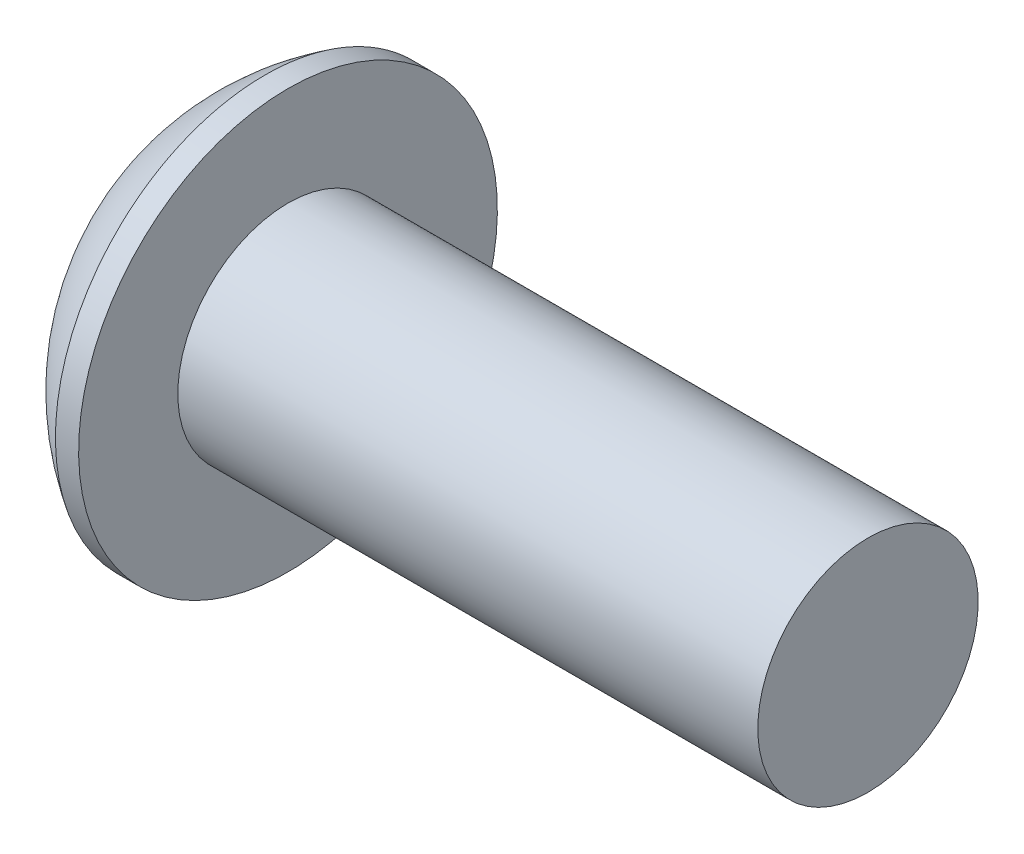
ISO-10303-21;
HEADER;
FILE_DESCRIPTION(('STEP AP214'),'2;1');
FILE_NAME('part.step','',(''),(''),'','','');
FILE_SCHEMA(('AUTOMOTIVE_DESIGN { 1 0 10303 214 1 1 1 1 }'));
ENDSEC;
DATA;
#1=APPLICATION_CONTEXT('core data for automotive mechanical design processes');
#2=APPLICATION_PROTOCOL_DEFINITION('international standard','automotive_design',2000,#1);
#3=PRODUCT_CONTEXT('',#1,'mechanical');
#4=PRODUCT('Part','Part','',(#3));
#5=PRODUCT_RELATED_PRODUCT_CATEGORY('part','',(#4));
#6=PRODUCT_DEFINITION_FORMATION('','',#4);
#7=PRODUCT_DEFINITION_CONTEXT('part definition',#1,'design');
#8=PRODUCT_DEFINITION('design','',#6,#7);
#9=PRODUCT_DEFINITION_SHAPE('','',#8);
#10=(LENGTH_UNIT() NAMED_UNIT(*) SI_UNIT(.MILLI.,.METRE.));
#11=(NAMED_UNIT(*) PLANE_ANGLE_UNIT() SI_UNIT($,.RADIAN.));
#12=(NAMED_UNIT(*) SI_UNIT($,.STERADIAN.) SOLID_ANGLE_UNIT());
#13=UNCERTAINTY_MEASURE_WITH_UNIT(LENGTH_MEASURE(1.E-05),#10,'distance_accuracy_value','');
#14=(GEOMETRIC_REPRESENTATION_CONTEXT(3) GLOBAL_UNCERTAINTY_ASSIGNED_CONTEXT((#13)) GLOBAL_UNIT_ASSIGNED_CONTEXT((#10,
#11,#12)) REPRESENTATION_CONTEXT('',''));
#15=CARTESIAN_POINT('',(0.,0.,0.));
#16=DIRECTION('',(0.,0.,1.));
#17=DIRECTION('',(1.,0.,0.));
#18=AXIS2_PLACEMENT_3D('',#15,#16,#17);
#19=CARTESIAN_POINT('',(-0.533400000000002,0.,0.));
#20=DIRECTION('',(-1.,0.,0.));
#21=DIRECTION('',(0.,0.,1.));
#22=AXIS2_PLACEMENT_3D('',#19,#20,#21);
#23=PLANE('',#22);
#24=DIRECTION('',(0.,0.5,0.866025403784439));
#25=VECTOR('',#24,1.);
#26=CARTESIAN_POINT('',(-0.533400000000002,1.83308710467706,0.));
#27=LINE('',#26,#25);
#28=CARTESIAN_POINT('',(-0.533400000000002,1.83308710467706,0.));
#29=VERTEX_POINT('',#28);
#30=CARTESIAN_POINT('',(-0.533400000000002,0.916543552338531,-1.5875));
#31=VERTEX_POINT('',#30);
#32=EDGE_CURVE('E114',#29,#31,#27,.F.);
#33=ORIENTED_EDGE('',*,*,#32,.T.);
#34=DIRECTION('',(0.,1.,0.));
#35=VECTOR('',#34,1.);
#36=CARTESIAN_POINT('',(-0.533400000000002,0.916543552338531,-1.5875));
#37=LINE('',#36,#35);
#38=CARTESIAN_POINT('',(-0.533400000000002,-0.916543552338531,-1.5875));
#39=VERTEX_POINT('',#38);
#40=EDGE_CURVE('E81',#31,#39,#37,.F.);
#41=ORIENTED_EDGE('',*,*,#40,.T.);
#42=DIRECTION('',(0.,0.5,-0.866025403784439));
#43=VECTOR('',#42,1.);
#44=CARTESIAN_POINT('',(-0.533400000000002,-0.916543552338531,-1.5875));
#45=LINE('',#44,#43);
#46=CARTESIAN_POINT('',(-0.533400000000002,-1.83308710467706,0.));
#47=VERTEX_POINT('',#46);
#48=EDGE_CURVE('E83',#39,#47,#45,.F.);
#49=ORIENTED_EDGE('',*,*,#48,.T.);
#50=DIRECTION('',(0.,-0.5,-0.866025403784439));
#51=VECTOR('',#50,1.);
#52=CARTESIAN_POINT('',(-0.533400000000002,-1.83308710467706,0.));
#53=LINE('',#52,#51);
#54=CARTESIAN_POINT('',(-0.533400000000002,-0.916543552338533,1.5875));
#55=VERTEX_POINT('',#54);
#56=EDGE_CURVE('E84',#47,#55,#53,.F.);
#57=ORIENTED_EDGE('',*,*,#56,.T.);
#58=DIRECTION('',(0.,-1.,0.));
#59=VECTOR('',#58,1.);
#60=CARTESIAN_POINT('',(-0.533400000000002,-0.916543552338532,1.5875));
#61=LINE('',#60,#59);
#62=CARTESIAN_POINT('',(-0.533400000000002,0.916543552338531,1.5875));
#63=VERTEX_POINT('',#62);
#64=EDGE_CURVE('E70',#55,#63,#61,.F.);
#65=ORIENTED_EDGE('',*,*,#64,.T.);
#66=DIRECTION('',(0.,-0.5,0.866025403784439));
#67=VECTOR('',#66,1.);
#68=CARTESIAN_POINT('',(-0.533400000000002,0.916543552338531,1.5875));
#69=LINE('',#68,#67);
#70=EDGE_CURVE('E109',#63,#29,#69,.F.);
#71=ORIENTED_EDGE('',*,*,#70,.T.);
#72=EDGE_LOOP('',(#33,#41,#49,#57,#65,#71));
#73=FACE_BOUND('',#72,.T.);
#74=ADVANCED_FACE('F16',(#73),#23,.T.);
#75=CARTESIAN_POINT('',(-0.533400000000002,-1.83308710467706,0.));
#76=DIRECTION('',(0.,-0.866025403784439,0.5));
#77=DIRECTION('',(0.,-0.5,-0.866025403784439));
#78=AXIS2_PLACEMENT_3D('',#75,#76,#77);
#79=PLANE('',#78);
#80=CARTESIAN_POINT('',(-2.56539999994394,-1.8330871046745,-2.00804498786736E-11));
#81=CARTESIAN_POINT('',(-2.53392818229741,-1.80158505518366,0.0545631502562923));
#82=CARTESIAN_POINT('',(-2.5043050627177,-1.76955629074211,0.110038597579172));
#83=CARTESIAN_POINT('',(-2.45006639539122,-1.70424635317817,0.223158727683824));
#84=CARTESIAN_POINT('',(-2.42548101615987,-1.6709589724711,0.280814162317604));
#85=CARTESIAN_POINT('',(-2.38336609605347,-1.60383660211837,0.397073518091736));
#86=CARTESIAN_POINT('',(-2.36573072948629,-1.57001869730198,0.455647847439699));
#87=CARTESIAN_POINT('',(-2.33856008862263,-1.50163859306838,0.574085662199493));
#88=CARTESIAN_POINT('',(-2.32900454007239,-1.46707848106388,0.633945532106421));
#89=CARTESIAN_POINT('',(-2.32038274183869,-1.40751253669323,0.737116774157155));
#90=CARTESIAN_POINT('',(-2.31910682172836,-1.38258360390154,0.780294952330845));
#91=CARTESIAN_POINT('',(-2.32125913780735,-1.33276652395073,0.866580665890379));
#92=CARTESIAN_POINT('',(-2.32468902284537,-1.30787839414808,0.90968817121394));
#93=CARTESIAN_POINT('',(-2.33605631415915,-1.25834345643267,0.995485200086784));
#94=CARTESIAN_POINT('',(-2.34399762019329,-1.23369687609494,1.03817432946455));
#95=CARTESIAN_POINT('',(-2.36395627681902,-1.18481740842653,1.12283605091316));
#96=CARTESIAN_POINT('',(-2.37597537628367,-1.16058470328902,1.16480832741616));
#97=CARTESIAN_POINT('',(-2.41164383187845,-1.09853862948576,1.27227527965358));
#98=CARTESIAN_POINT('',(-2.43797770752625,-1.06110942924036,1.33710455616529));
#99=CARTESIAN_POINT('',(-2.48243061452926,-1.00607390269188,1.43242888436855));
#100=CARTESIAN_POINT('',(-2.49804835924321,-0.987937988038022,1.46384120999077));
#101=CARTESIAN_POINT('',(-2.53070945051393,-0.951999508520197,1.52608848246242));
#102=CARTESIAN_POINT('',(-2.54775211871235,-0.934196789917587,1.55692369559499));
#103=CARTESIAN_POINT('',(-2.56539999993807,-0.916543552329633,1.58750000001541));
#104=B_SPLINE_CURVE_WITH_KNOTS('',3,(#80,#81,#82,#83,#84,#85,#86,#87,#88,#89,#90,#91,#92,#93,
#94,#95,#96,#97,#98,#99,#100,#101,#102,#103),.UNSPECIFIED.,.F.,.F.,(4,2,2,2,2,2,2,2,2,2,2,4),
(0.,0.211427927732169,0.424087197148228,0.633370156422424,0.842126401515785,0.991537201098734,
1.14100036552056,1.29059292577265,1.44024972414947,1.67781721417335,1.79627069411587,
1.91466809995991),.UNSPECIFIED.);
#105=CARTESIAN_POINT('',(-2.56539999993857,-1.83308710468646,0.));
#106=VERTEX_POINT('',#105);
#107=CARTESIAN_POINT('',(-2.56539999993106,-0.916543552342318,1.5875));
#108=VERTEX_POINT('',#107);
#109=EDGE_CURVE('E19',#106,#108,#104,.T.);
#110=ORIENTED_EDGE('',*,*,#109,.T.);
#111=DIRECTION('',(1.,0.,0.));
#112=VECTOR('',#111,1.);
#113=CARTESIAN_POINT('',(-0.533400000000002,-0.916543552338533,1.5875));
#114=LINE('',#113,#112);
#115=EDGE_CURVE('E89',#108,#55,#114,.T.);
#116=ORIENTED_EDGE('',*,*,#115,.T.);
#117=ORIENTED_EDGE('',*,*,#56,.F.);
#118=DIRECTION('',(1.,0.,0.));
#119=VECTOR('',#118,1.);
#120=CARTESIAN_POINT('',(-0.533400000000002,-1.83308710467706,0.));
#121=LINE('',#120,#119);
#122=EDGE_CURVE('E57',#47,#106,#121,.F.);
#123=ORIENTED_EDGE('',*,*,#122,.T.);
#124=EDGE_LOOP('',(#110,#116,#117,#123));
#125=FACE_BOUND('',#124,.T.);
#126=ADVANCED_FACE('F88',(#125),#79,.F.);
#127=CARTESIAN_POINT('',(-0.533400000000002,-0.916543552338531,-1.5875));
#128=DIRECTION('',(0.,-0.866025403784439,-0.5));
#129=DIRECTION('',(0.,0.5,-0.866025403784439));
#130=AXIS2_PLACEMENT_3D('',#127,#128,#129);
#131=PLANE('',#130);
#132=CARTESIAN_POINT('',(-2.56539999994527,-0.916543552319403,-1.58750000001409));
#133=CARTESIAN_POINT('',(-2.53392818229919,-0.948045601822691,-1.53293684974403));
#134=CARTESIAN_POINT('',(-2.50430506271949,-0.980074366269487,-1.47746140242354));
#135=CARTESIAN_POINT('',(-2.45006639539264,-1.04538430383757,-1.36434127232016));
#136=CARTESIAN_POINT('',(-2.42548101616093,-1.07867168454351,-1.30668583768523));
#137=CARTESIAN_POINT('',(-2.38336609605398,-1.14579405489574,-1.19042648190974));
#138=CARTESIAN_POINT('',(-2.36573072948662,-1.17961195971273,-1.13185215256154));
#139=CARTESIAN_POINT('',(-2.3385600886227,-1.2479920639471,-1.013414337801));
#140=CARTESIAN_POINT('',(-2.32900454007237,-1.28255217595175,-0.953554467893575));
#141=CARTESIAN_POINT('',(-2.32038274183866,-1.34211812032265,-0.850383225842316));
#142=CARTESIAN_POINT('',(-2.31910682172835,-1.36704705311438,-0.807205047668587));
#143=CARTESIAN_POINT('',(-2.32125913780739,-1.41686413306525,-0.720919334108961));
#144=CARTESIAN_POINT('',(-2.32468902284544,-1.44175226286793,-0.67781182878535));
#145=CARTESIAN_POINT('',(-2.33605631415929,-1.49128720058339,-0.592014799912417));
#146=CARTESIAN_POINT('',(-2.34399762019345,-1.51593378092113,-0.54932567053461));
#147=CARTESIAN_POINT('',(-2.36395627681926,-1.56481324858959,-0.464663949085931));
#148=CARTESIAN_POINT('',(-2.37597537628395,-1.58904595372712,-0.422691672582891));
#149=CARTESIAN_POINT('',(-2.41164383187876,-1.65109202753029,-0.315224720345625));
#150=CARTESIAN_POINT('',(-2.43797770752652,-1.6885212277756,-0.250395443834082));
#151=CARTESIAN_POINT('',(-2.48243061452944,-1.74355675432393,-0.15507111563107));
#152=CARTESIAN_POINT('',(-2.49804835924337,-1.76169266897775,-0.123658790008927));
#153=CARTESIAN_POINT('',(-2.53070945051401,-1.79763114849548,-0.0614115175374324));
#154=CARTESIAN_POINT('',(-2.5477521187124,-1.81543386709805,-0.0305763044049344));
#155=CARTESIAN_POINT('',(-2.56539999993807,-1.83308710468596,1.54136844652939E-11));
#156=B_SPLINE_CURVE_WITH_KNOTS('',3,(#132,#133,#134,#135,#136,#137,#138,#139,#140,#141,#142,
#143,#144,#145,#146,#147,#148,#149,#150,#151,#152,#153,#154,#155),.UNSPECIFIED.,.F.,.F.,(4,2,2,
2,2,2,2,2,2,2,2,4),(0.,0.211427927733669,0.424087197151313,0.633370156427101,0.842126401522016,
0.99153720110513,1.14100036552713,1.29059292577937,1.44024972415633,1.67781721417961,
1.79627069412184,1.9146680999656),.UNSPECIFIED.);
#157=CARTESIAN_POINT('',(-2.56539999995198,-0.916543552351339,-1.58750000002218));
#158=VERTEX_POINT('',#157);
#159=EDGE_CURVE('E93',#158,#106,#156,.T.);
#160=ORIENTED_EDGE('',*,*,#159,.T.);
#161=ORIENTED_EDGE('',*,*,#122,.F.);
#162=ORIENTED_EDGE('',*,*,#48,.F.);
#163=DIRECTION('',(-1.,0.,0.));
#164=VECTOR('',#163,1.);
#165=CARTESIAN_POINT('',(-0.533400000000002,-0.916543552338531,-1.5875));
#166=LINE('',#165,#164);
#167=EDGE_CURVE('E95',#39,#158,#166,.T.);
#168=ORIENTED_EDGE('',*,*,#167,.T.);
#169=EDGE_LOOP('',(#160,#161,#162,#168));
#170=FACE_BOUND('',#169,.T.);
#171=ADVANCED_FACE('F91',(#170),#131,.F.);
#172=CARTESIAN_POINT('',(-0.533400000000002,0.916543552338531,-1.5875));
#173=DIRECTION('',(0.,0.,-1.));
#174=DIRECTION('',(-1.,0.,0.));
#175=AXIS2_PLACEMENT_3D('',#172,#173,#174);
#176=PLANE('',#175);
#177=CARTESIAN_POINT('',(-2.56539999994527,0.916543552360294,-1.58749999999048));
#178=CARTESIAN_POINT('',(-2.53392818229821,0.853539453376781,-1.58749999999657));
#179=CARTESIAN_POINT('',(-2.50430506271702,0.789481924500113,-1.58749999999908));
#180=CARTESIAN_POINT('',(-2.45006639538581,0.658862049392287,-1.58750000000093));
#181=CARTESIAN_POINT('',(-2.42548101615122,0.59228728799181,-1.58750000000025));
#182=CARTESIAN_POINT('',(-2.38336609603683,0.458042547310979,-1.58749999999976));
#183=CARTESIAN_POINT('',(-2.36573072946494,0.390406737689213,-1.58749999999994));
#184=CARTESIAN_POINT('',(-2.3385600885904,0.253646529243895,-1.58750000000006));
#185=CARTESIAN_POINT('',(-2.32900454003397,0.184526305245804,-1.58750000000001));
#186=CARTESIAN_POINT('',(-2.32038274178942,0.0653944165301613,-1.58749999999999));
#187=CARTESIAN_POINT('',(-2.31910682167392,0.0155365509618711,-1.5875));
#188=CARTESIAN_POINT('',(-2.3212591377409,-0.0840976089101244,-1.5875));
#189=CARTESIAN_POINT('',(-2.32468902277208,-0.133873868500894,-1.5875));
#190=CARTESIAN_POINT('',(-2.33605631407098,-0.2329437439033,-1.5875));
#191=CARTESIAN_POINT('',(-2.34399762009707,-0.282236904564879,-1.5875));
#192=CARTESIAN_POINT('',(-2.36395627670599,-0.379995839874564,-1.5875));
#193=CARTESIAN_POINT('',(-2.37597537616188,-0.428461250136325,-1.5875));
#194=CARTESIAN_POINT('',(-2.41164383175616,-0.552553397787632,-1.5875));
#195=CARTESIAN_POINT('',(-2.43797770742117,-0.627411798334259,-1.5875));
#196=CARTESIAN_POINT('',(-2.48243061445881,-0.737482851511091,-1.5875));
#197=CARTESIAN_POINT('',(-2.49804835918582,-0.773754680844889,-1.5875));
#198=CARTESIAN_POINT('',(-2.53070945048496,-0.845631639931401,-1.5875));
#199=CARTESIAN_POINT('',(-2.54775211869874,-0.881237077161412,-1.5875));
#200=CARTESIAN_POINT('',(-2.56539999994071,-0.916543552361606,-1.5875));
#201=B_SPLINE_CURVE_WITH_KNOTS('',3,(#177,#178,#179,#180,#181,#182,#183,#184,#185,#186,#187,
#188,#189,#190,#191,#192,#193,#194,#195,#196,#197,#198,#199,#200),.UNSPECIFIED.,.F.,.F.,(4,2,2,
2,2,2,2,2,2,2,2,4),(0.,0.211427927701375,0.424087197086717,0.633370156331471,0.842126401395377,
0.991537200933545,1.14100036531054,1.29059292551773,1.44024972384963,1.677817214047,
1.79627069407681,1.91466810000777),.UNSPECIFIED.);
#202=CARTESIAN_POINT('',(-2.56539999995198,0.916543552337129,-1.58749999999757));
#203=VERTEX_POINT('',#202);
#204=EDGE_CURVE('E197',#203,#158,#201,.T.);
#205=ORIENTED_EDGE('',*,*,#204,.T.);
#206=ORIENTED_EDGE('',*,*,#167,.F.);
#207=ORIENTED_EDGE('',*,*,#40,.F.);
#208=DIRECTION('',(1.,0.,0.));
#209=VECTOR('',#208,1.);
#210=CARTESIAN_POINT('',(-0.533400000000002,0.916543552338531,-1.5875));
#211=LINE('',#210,#209);
#212=EDGE_CURVE('E111',#31,#203,#211,.F.);
#213=ORIENTED_EDGE('',*,*,#212,.T.);
#214=EDGE_LOOP('',(#205,#206,#207,#213));
#215=FACE_BOUND('',#214,.T.);
#216=ADVANCED_FACE('F187',(#215),#176,.F.);
#217=CARTESIAN_POINT('',(-0.533400000000002,1.83308710467706,0.));
#218=DIRECTION('',(0.,0.866025403784439,-0.5));
#219=DIRECTION('',(0.,0.5,0.866025403784439));
#220=AXIS2_PLACEMENT_3D('',#217,#218,#219);
#221=PLANE('',#220);
#222=CARTESIAN_POINT('',(-2.56539999994394,1.8330871046745,2.00800374309997E-11));
#223=CARTESIAN_POINT('',(-2.5339281822974,1.80158505518366,-0.0545631502562965));
#224=CARTESIAN_POINT('',(-2.5043050627177,1.76955629074211,-0.11003859757918));
#225=CARTESIAN_POINT('',(-2.45006639539121,1.70424635317816,-0.22315872768384));
#226=CARTESIAN_POINT('',(-2.42548101615987,1.67095897247109,-0.280814162317626));
#227=CARTESIAN_POINT('',(-2.38336609605347,1.60383660211835,-0.397073518091758));
#228=CARTESIAN_POINT('',(-2.36573072948628,1.57001869730197,-0.455647847439717));
#229=CARTESIAN_POINT('',(-2.33856008862263,1.50163859306837,-0.574085662199503));
#230=CARTESIAN_POINT('',(-2.32900454007239,1.46707848106388,-0.633945532106426));
#231=CARTESIAN_POINT('',(-2.32038274183869,1.40751253669322,-0.737116774157154));
#232=CARTESIAN_POINT('',(-2.31910682172836,1.38258360390154,-0.780294952330843));
#233=CARTESIAN_POINT('',(-2.32125913780735,1.33276652395073,-0.866580665890374));
#234=CARTESIAN_POINT('',(-2.32468902284537,1.30787839414808,-0.909688171213933));
#235=CARTESIAN_POINT('',(-2.33605631415915,1.25834345643267,-0.995485200086777));
#236=CARTESIAN_POINT('',(-2.34399762019328,1.23369687609495,-1.03817432946455));
#237=CARTESIAN_POINT('',(-2.36395627681902,1.18481740842653,-1.12283605091316));
#238=CARTESIAN_POINT('',(-2.37597537628367,1.16058470328902,-1.16480832741616));
#239=CARTESIAN_POINT('',(-2.41164383187872,1.09853862948529,-1.2722752796544));
#240=CARTESIAN_POINT('',(-2.43797770752691,1.06110942923942,-1.33710455616691));
#241=CARTESIAN_POINT('',(-2.48243061453059,1.00607390269029,-1.43242888437131));
#242=CARTESIAN_POINT('',(-2.49804835924479,0.987937988036214,-1.4638412099939));
#243=CARTESIAN_POINT('',(-2.53070945051602,0.951999508517968,-1.52608848246628));
#244=CARTESIAN_POINT('',(-2.54775211871471,0.934196789915152,-1.55692369559921));
#245=CARTESIAN_POINT('',(-2.56539999994071,0.916543552326994,-1.58750000001998));
#246=B_SPLINE_CURVE_WITH_KNOTS('',3,(#222,#223,#224,#225,#226,#227,#228,#229,#230,#231,#232,
#233,#234,#235,#236,#237,#238,#239,#240,#241,#242,#243,#244,#245),.UNSPECIFIED.,.F.,.F.,(4,2,2,
2,2,2,2,2,2,2,2,4),(0.,0.211427927732185,0.424087197148259,0.63337015642244,0.842126401515786,
0.99153720109873,1.14100036552055,1.29059292577265,1.44024972414947,1.67781721417631,
1.7962706941203,1.9146680999658),.UNSPECIFIED.);
#247=CARTESIAN_POINT('',(-2.56539999993857,1.83308710468646,0.));
#248=VERTEX_POINT('',#247);
#249=EDGE_CURVE('E191',#248,#203,#246,.T.);
#250=ORIENTED_EDGE('',*,*,#249,.T.);
#251=ORIENTED_EDGE('',*,*,#212,.F.);
#252=ORIENTED_EDGE('',*,*,#32,.F.);
#253=DIRECTION('',(1.,0.,0.));
#254=VECTOR('',#253,1.);
#255=CARTESIAN_POINT('',(-0.533400000000002,1.83308710467706,0.));
#256=LINE('',#255,#254);
#257=EDGE_CURVE('E106',#29,#248,#256,.F.);
#258=ORIENTED_EDGE('',*,*,#257,.T.);
#259=EDGE_LOOP('',(#250,#251,#252,#258));
#260=FACE_BOUND('',#259,.T.);
#261=ADVANCED_FACE('F183',(#260),#221,.F.);
#262=CARTESIAN_POINT('',(-0.533400000000002,0.916543552338531,1.5875));
#263=DIRECTION('',(0.,0.866025403784439,0.5));
#264=DIRECTION('',(0.,-0.5,0.866025403784439));
#265=AXIS2_PLACEMENT_3D('',#262,#263,#264);
#266=PLANE('',#265);
#267=CARTESIAN_POINT('',(-2.56539999994394,0.91654355231986,1.58750000000782));
#268=CARTESIAN_POINT('',(-2.53392818229741,0.948045601824288,1.5329368497393));
#269=CARTESIAN_POINT('',(-2.5043050627177,0.980074366271431,1.47746140241964));
#270=CARTESIAN_POINT('',(-2.45006639539122,1.04538430383949,1.36434127231737));
#271=CARTESIAN_POINT('',(-2.42548101615987,1.07867168454504,1.30668583768271));
#272=CARTESIAN_POINT('',(-2.38336609605347,1.14579405489669,1.19042648190795));
#273=CARTESIAN_POINT('',(-2.36573072948629,1.17961195971347,1.13185215256022));
#274=CARTESIAN_POINT('',(-2.33856008862263,1.24799206394736,1.01341433780059));
#275=CARTESIAN_POINT('',(-2.32900454007239,1.28255217595174,0.953554467893597));
#276=CARTESIAN_POINT('',(-2.32038274183869,1.34211812032234,0.850383225842832));
#277=CARTESIAN_POINT('',(-2.31910682172836,1.36704705311405,0.807205047669152));
#278=CARTESIAN_POINT('',(-2.32125913780735,1.41686413306487,0.720919334109624));
#279=CARTESIAN_POINT('',(-2.32468902284537,1.44175226286752,0.677811828786061));
#280=CARTESIAN_POINT('',(-2.33605631415915,1.49128720058292,0.592014799913215));
#281=CARTESIAN_POINT('',(-2.34399762019328,1.51593378092065,0.549325670535446));
#282=CARTESIAN_POINT('',(-2.36395627681902,1.56481324858906,0.464663949086841));
#283=CARTESIAN_POINT('',(-2.37597537628367,1.58904595372657,0.422691672583837));
#284=CARTESIAN_POINT('',(-2.41164383187845,1.65109202752983,0.315224720346425));
#285=CARTESIAN_POINT('',(-2.43797770752625,1.68852122777524,0.250395443834706));
#286=CARTESIAN_POINT('',(-2.48243061452926,1.74355675432371,0.155071115631445));
#287=CARTESIAN_POINT('',(-2.49804835924321,1.76169266897757,0.123658790009225));
#288=CARTESIAN_POINT('',(-2.53070945051393,1.7976311484954,0.0614115175375789));
#289=CARTESIAN_POINT('',(-2.54775211871235,1.81543386709801,0.0305763044050067));
#290=CARTESIAN_POINT('',(-2.56539999993807,1.83308710468596,-1.54142580803093E-11));
#291=B_SPLINE_CURVE_WITH_KNOTS('',3,(#267,#268,#269,#270,#271,#272,#273,#274,#275,#276,#277,
#278,#279,#280,#281,#282,#283,#284,#285,#286,#287,#288,#289,#290),.UNSPECIFIED.,.F.,.F.,(4,2,2,
2,2,2,2,2,2,2,2,4),(0.,0.211427927732169,0.424087197148227,0.633370156422423,0.842126401515785,
0.991537201098733,1.14100036552056,1.29059292577265,1.44024972414946,1.67781721417335,
1.79627069411587,1.91466809995991),.UNSPECIFIED.);
#292=CARTESIAN_POINT('',(-2.56539999993857,0.91654355234323,1.58750000000814));
#293=VERTEX_POINT('',#292);
#294=EDGE_CURVE('E165',#293,#248,#291,.T.);
#295=ORIENTED_EDGE('',*,*,#294,.T.);
#296=ORIENTED_EDGE('',*,*,#257,.F.);
#297=ORIENTED_EDGE('',*,*,#70,.F.);
#298=DIRECTION('',(1.,0.,0.));
#299=VECTOR('',#298,1.);
#300=CARTESIAN_POINT('',(-0.533400000000002,0.916543552338531,1.5875));
#301=LINE('',#300,#299);
#302=EDGE_CURVE('E38',#63,#293,#301,.F.);
#303=ORIENTED_EDGE('',*,*,#302,.T.);
#304=EDGE_LOOP('',(#295,#296,#297,#303));
#305=FACE_BOUND('',#304,.T.);
#306=ADVANCED_FACE('F176',(#305),#266,.F.);
#307=CARTESIAN_POINT('',(-0.533400000000002,-0.916543552338532,1.5875));
#308=DIRECTION('',(0.,0.,1.));
#309=DIRECTION('',(0.,-1.,0.));
#310=AXIS2_PLACEMENT_3D('',#307,#308,#309);
#311=PLANE('',#310);
#312=CARTESIAN_POINT('',(-2.56539999994394,-0.916543552354642,1.58749999998774));
#313=CARTESIAN_POINT('',(-2.53392818229741,-0.853539453359365,1.58749999999559));
#314=CARTESIAN_POINT('',(-2.50430506271771,-0.789481924470656,1.58749999999882));
#315=CARTESIAN_POINT('',(-2.45006639539122,-0.658862049338629,1.58750000000119));
#316=CARTESIAN_POINT('',(-2.42548101615988,-0.592287287925995,1.58750000000032));
#317=CARTESIAN_POINT('',(-2.38336609605349,-0.458042547221593,1.58749999999969));
#318=CARTESIAN_POINT('',(-2.36573072948631,-0.390406737588416,1.58749999999992));
#319=CARTESIAN_POINT('',(-2.33856008862266,-0.253646529120892,1.58750000000008));
#320=CARTESIAN_POINT('',(-2.32900454007243,-0.184526305112002,1.58750000000002));
#321=CARTESIAN_POINT('',(-2.32038274183874,-0.065394416370719,1.58749999999999));
#322=CARTESIAN_POINT('',(-2.31910682172841,-0.0155365507873145,1.5875));
#323=CARTESIAN_POINT('',(-2.32125913780742,0.0840976091143436,1.5875));
#324=CARTESIAN_POINT('',(-2.32468902284545,0.133873868719661,1.5875));
#325=CARTESIAN_POINT('',(-2.33605631415924,0.232943744150505,1.5875));
#326=CARTESIAN_POINT('',(-2.34399762019338,0.282236904825971,1.5875));
#327=CARTESIAN_POINT('',(-2.36395627681913,0.379995840162817,1.5875));
#328=CARTESIAN_POINT('',(-2.37597537628379,0.428461250437852,1.5875));
#329=CARTESIAN_POINT('',(-2.41164383187857,0.552553398044325,1.5875));
#330=CARTESIAN_POINT('',(-2.43797770752636,0.627411798535089,1.5875));
#331=CARTESIAN_POINT('',(-2.48243061452933,0.737482851631955,1.5875));
#332=CARTESIAN_POINT('',(-2.49804835924327,0.773754680939651,1.5875));
#333=CARTESIAN_POINT('',(-2.53070945051396,0.84563163997525,1.5875));
#334=CARTESIAN_POINT('',(-2.54775211871237,0.881237077180446,1.5875));
#335=CARTESIAN_POINT('',(-2.56539999993807,0.91654355235633,1.5875));
#336=B_SPLINE_CURVE_WITH_KNOTS('',3,(#312,#313,#314,#315,#316,#317,#318,#319,#320,#321,#322,
#323,#324,#325,#326,#327,#328,#329,#330,#331,#332,#333,#334,#335),.UNSPECIFIED.,.F.,.F.,(4,2,2,
2,2,2,2,2,2,2,2,4),(0.,0.211427927732202,0.424087197148294,0.633370156422521,0.842126401515914,
0.991537201098908,1.14100036552078,1.29059292577292,1.44024972414978,1.67781721417349,
1.79627069411592,1.91466809995988),.UNSPECIFIED.);
#337=EDGE_CURVE('E157',#108,#293,#336,.T.);
#338=ORIENTED_EDGE('',*,*,#337,.T.);
#339=ORIENTED_EDGE('',*,*,#302,.F.);
#340=ORIENTED_EDGE('',*,*,#64,.F.);
#341=ORIENTED_EDGE('',*,*,#115,.F.);
#342=EDGE_LOOP('',(#338,#339,#340,#341));
#343=FACE_BOUND('',#342,.T.);
#344=ADVANCED_FACE('F172',(#343),#311,.F.);
#345=CARTESIAN_POINT('',(-2.56540000003724,0.,0.));
#346=DIRECTION('',(-1.,0.,0.));
#347=DIRECTION('',(0.,-1.,0.));
#348=AXIS2_PLACEMENT_3D('',#345,#346,#347);
#349=CONICAL_SURFACE('',#348,1.83308710478514,0.78539816351237);
#350=ORIENTED_EDGE('',*,*,#109,.F.);
#351=CARTESIAN_POINT('',(-2.56539999992356,0.,0.));
#352=DIRECTION('',(-1.,0.,0.));
#353=DIRECTION('',(0.,-1.,0.));
#354=AXIS2_PLACEMENT_3D('',#351,#352,#353);
#355=CIRCLE('',#354,1.83308710467145);
#356=EDGE_CURVE('E164',#108,#106,#355,.F.);
#357=ORIENTED_EDGE('',*,*,#356,.F.);
#358=EDGE_LOOP('',(#350,#357));
#359=FACE_BOUND('',#358,.T.);
#360=ADVANCED_FACE('F175',(#359),#349,.F.);
#361=CARTESIAN_POINT('',(-2.56540000003724,0.,0.));
#362=DIRECTION('',(-1.,0.,0.));
#363=DIRECTION('',(0.,-1.,0.));
#364=AXIS2_PLACEMENT_3D('',#361,#362,#363);
#365=CONICAL_SURFACE('',#364,1.83308710478514,0.78539816351237);
#366=ORIENTED_EDGE('',*,*,#159,.F.);
#367=CARTESIAN_POINT('',(-2.56539999992356,0.,0.));
#368=DIRECTION('',(-1.,0.,0.));
#369=DIRECTION('',(0.,-1.,0.));
#370=AXIS2_PLACEMENT_3D('',#367,#368,#369);
#371=CIRCLE('',#370,1.83308710467145);
#372=EDGE_CURVE('E272',#106,#158,#371,.F.);
#373=ORIENTED_EDGE('',*,*,#372,.F.);
#374=EDGE_LOOP('',(#366,#373));
#375=FACE_BOUND('',#374,.T.);
#376=ADVANCED_FACE('F209',(#375),#365,.F.);
#377=CARTESIAN_POINT('',(-2.56540000003724,0.,0.));
#378=DIRECTION('',(-1.,0.,0.));
#379=DIRECTION('',(0.,-1.,0.));
#380=AXIS2_PLACEMENT_3D('',#377,#378,#379);
#381=CONICAL_SURFACE('',#380,1.83308710478514,0.785398163397448);
#382=ORIENTED_EDGE('',*,*,#204,.F.);
#383=CARTESIAN_POINT('',(-2.5653999999804,0.,0.));
#384=DIRECTION('',(-1.,0.,0.));
#385=DIRECTION('',(0.,-1.,0.));
#386=AXIS2_PLACEMENT_3D('',#383,#384,#385);
#387=CIRCLE('',#386,1.83308710472829);
#388=EDGE_CURVE('E269',#158,#203,#387,.F.);
#389=ORIENTED_EDGE('',*,*,#388,.F.);
#390=EDGE_LOOP('',(#382,#389));
#391=FACE_BOUND('',#390,.T.);
#392=ADVANCED_FACE('F205',(#391),#381,.F.);
#393=CARTESIAN_POINT('',(-2.56540000003724,0.,0.));
#394=DIRECTION('',(-1.,0.,0.));
#395=DIRECTION('',(0.,-1.,0.));
#396=AXIS2_PLACEMENT_3D('',#393,#394,#395);
#397=CONICAL_SURFACE('',#396,1.83308710478514,0.78539816351237);
#398=ORIENTED_EDGE('',*,*,#249,.F.);
#399=CARTESIAN_POINT('',(-2.56539999992356,0.,0.));
#400=DIRECTION('',(-1.,0.,0.));
#401=DIRECTION('',(0.,-1.,0.));
#402=AXIS2_PLACEMENT_3D('',#399,#400,#401);
#403=CIRCLE('',#402,1.83308710467145);
#404=EDGE_CURVE('E266',#203,#248,#403,.F.);
#405=ORIENTED_EDGE('',*,*,#404,.F.);
#406=EDGE_LOOP('',(#398,#405));
#407=FACE_BOUND('',#406,.T.);
#408=ADVANCED_FACE('F202',(#407),#397,.F.);
#409=CARTESIAN_POINT('',(-2.56540000003724,0.,0.));
#410=DIRECTION('',(-1.,0.,0.));
#411=DIRECTION('',(0.,-1.,0.));
#412=AXIS2_PLACEMENT_3D('',#409,#410,#411);
#413=CONICAL_SURFACE('',#412,1.83308710478514,0.78539816351237);
#414=ORIENTED_EDGE('',*,*,#294,.F.);
#415=CARTESIAN_POINT('',(-2.56539999992356,0.,0.));
#416=DIRECTION('',(-1.,0.,0.));
#417=DIRECTION('',(0.,-1.,0.));
#418=AXIS2_PLACEMENT_3D('',#415,#416,#417);
#419=CIRCLE('',#418,1.83308710467145);
#420=EDGE_CURVE('E261',#248,#293,#419,.F.);
#421=ORIENTED_EDGE('',*,*,#420,.F.);
#422=EDGE_LOOP('',(#414,#421));
#423=FACE_BOUND('',#422,.T.);
#424=ADVANCED_FACE('F152',(#423),#413,.F.);
#425=CARTESIAN_POINT('',(-2.56540000003724,0.,0.));
#426=DIRECTION('',(-1.,0.,0.));
#427=DIRECTION('',(0.,-1.,0.));
#428=AXIS2_PLACEMENT_3D('',#425,#426,#427);
#429=CONICAL_SURFACE('',#428,1.83308710478514,0.785398163512485);
#430=ORIENTED_EDGE('',*,*,#337,.F.);
#431=CARTESIAN_POINT('',(-2.56539999992356,0.,0.));
#432=DIRECTION('',(-1.,0.,0.));
#433=DIRECTION('',(0.,-1.,0.));
#434=AXIS2_PLACEMENT_3D('',#431,#432,#433);
#435=CIRCLE('',#434,1.83308710467145);
#436=EDGE_CURVE('E137',#293,#108,#435,.F.);
#437=ORIENTED_EDGE('',*,*,#436,.F.);
#438=EDGE_LOOP('',(#430,#437));
#439=FACE_BOUND('',#438,.T.);
#440=ADVANCED_FACE('F147',(#439),#429,.F.);
#441=CARTESIAN_POINT('',(-2.5654,0.,0.));
#442=DIRECTION('',(-1.,0.,0.));
#443=DIRECTION('',(0.,-1.,0.));
#444=AXIS2_PLACEMENT_3D('',#441,#442,#443);
#445=PLANE('',#444);
#446=CARTESIAN_POINT('',(-2.5654,-2.29235000000002,0.));
#447=CARTESIAN_POINT('',(-2.56540000000001,-2.29234961429958,-0.0643619991867162));
#448=CARTESIAN_POINT('',(-2.56540000000002,-2.28963695190109,-0.128735826629366));
#449=CARTESIAN_POINT('',(-2.56539999999999,-2.27880393843649,-0.257038618985287));
#450=CARTESIAN_POINT('',(-2.56539999999995,-2.27068199085128,-0.320967446929163));
#451=CARTESIAN_POINT('',(-2.56540000000006,-2.24906694794257,-0.448021254607718));
#452=CARTESIAN_POINT('',(-2.56540000000021,-2.23556532653462,-0.511144793381861));
#453=CARTESIAN_POINT('',(-2.56539999999979,-2.20328400495645,-0.636065176149322));
#454=CARTESIAN_POINT('',(-2.56539999999921,-2.18450002159115,-0.697860899533935));
#455=CARTESIAN_POINT('',(-2.56539999999869,-2.12048422735804,-0.88032980292775));
#456=CARTESIAN_POINT('',(-2.56539999999995,-2.0675359907946,-0.99839179592812));
#457=CARTESIAN_POINT('',(-2.56540000000006,-1.94254204858674,-1.22393765942148));
#458=CARTESIAN_POINT('',(-2.56539999999891,-1.87049561696644,-1.33142112758208));
#459=CARTESIAN_POINT('',(-2.56539999999932,-1.74974254194881,-1.48237719670935));
#460=CARTESIAN_POINT('',(-2.56539999999982,-1.70734573132302,-1.53101280076738));
#461=CARTESIAN_POINT('',(-2.56540000000018,-1.6186391029153,-1.62450601319185));
#462=CARTESIAN_POINT('',(-2.56540000000005,-1.57233309727313,-1.66936721890417));
#463=CARTESIAN_POINT('',(-2.56539999999995,-1.47608431707234,-1.7550488420402));
#464=CARTESIAN_POINT('',(-2.56539999999999,-1.42613990458995,-1.79586741981512));
#465=CARTESIAN_POINT('',(-2.56540000000002,-1.32299452541252,-1.87315615311523));
#466=CARTESIAN_POINT('',(-2.56540000000001,-1.26979280714188,-1.90962529930697));
#467=CARTESIAN_POINT('',(-2.56539999999999,-1.10588180153953,-2.0120772215109));
#468=CARTESIAN_POINT('',(-2.5654,-0.990764947001321,-2.07119486286667));
#469=CARTESIAN_POINT('',(-2.5654,-0.752302198839727,-2.16922858468856));
#470=CARTESIAN_POINT('',(-2.5654,-0.628956393121269,-2.2081448809145));
#471=CARTESIAN_POINT('',(-2.5654,-0.377466101733277,-2.2647275576592));
#472=CARTESIAN_POINT('',(-2.5654,-0.249321590440388,-2.28239382469379));
#473=CARTESIAN_POINT('',(-2.5654,0.0081143537161001,-2.29595665980956));
#474=CARTESIAN_POINT('',(-2.5654,0.137405786579698,-2.29185322789073));
#475=CARTESIAN_POINT('',(-2.5654,0.393449386933719,-2.2620096240906));
#476=CARTESIAN_POINT('',(-2.5654,0.520201567981077,-2.23626956775766));
#477=CARTESIAN_POINT('',(-2.5654,0.767645294384444,-2.16383549332687));
#478=CARTESIAN_POINT('',(-2.5654,0.888336774993549,-2.11714125142686));
#479=CARTESIAN_POINT('',(-2.5654,1.06210572146655,-2.03247976453654));
#480=CARTESIAN_POINT('',(-2.5654,1.11884498714066,-2.00180278323696));
#481=CARTESIAN_POINT('',(-2.5654,1.22954062855572,-1.93578011658036));
#482=CARTESIAN_POINT('',(-2.5654,1.28349764565392,-1.9004355139425));
#483=CARTESIAN_POINT('',(-2.5654,1.38821676641537,-1.82534174602348));
#484=CARTESIAN_POINT('',(-2.5654,1.43898030563028,-1.78559458231503));
#485=CARTESIAN_POINT('',(-2.5654,1.53701984534431,-1.70193996292362));
#486=CARTESIAN_POINT('',(-2.5654,1.5842924328055,-1.65802852924127));
#487=CARTESIAN_POINT('',(-2.5654,1.72023903553758,-1.52059650554139));
#488=CARTESIAN_POINT('',(-2.5654,1.80318066138239,-1.42127847626519));
#489=CARTESIAN_POINT('',(-2.5654,1.95118232345098,-1.21011519784664));
#490=CARTESIAN_POINT('',(-2.5654,2.01624303935584,-1.09827042509272));
#491=CARTESIAN_POINT('',(-2.5654,2.09907772661314,-0.923538238005839));
#492=CARTESIAN_POINT('',(-2.5654,2.12425103063558,-0.864058373981966));
#493=CARTESIAN_POINT('',(-2.5654,2.16947990046565,-0.743221562175601));
#494=CARTESIAN_POINT('',(-2.5654,2.18953960800684,-0.681866178863365));
#495=CARTESIAN_POINT('',(-2.5654,2.22438542051156,-0.557786972400356));
#496=CARTESIAN_POINT('',(-2.5654,2.23917985294818,-0.495065478128172));
#497=CARTESIAN_POINT('',(-2.5654,2.26343456384453,-0.368611258323514));
#498=CARTESIAN_POINT('',(-2.5654,2.27289641559285,-0.304878836759566));
#499=CARTESIAN_POINT('',(-2.5654,2.28388649696736,-0.200873029360621));
#500=CARTESIAN_POINT('',(-2.5654,2.28705930623293,-0.160766164180096));
#501=CARTESIAN_POINT('',(-2.5654,2.29129117827044,-0.0804410725432706));
#502=CARTESIAN_POINT('',(-2.5654,2.29235024104238,-0.0402228460869715));
#503=CARTESIAN_POINT('',(-2.56540000000001,2.29234961429956,0.0643619991867166));
#504=CARTESIAN_POINT('',(-2.56540000000002,2.28963695190107,0.128735826629366));
#505=CARTESIAN_POINT('',(-2.56539999999999,2.27880393843648,0.257038618985288));
#506=CARTESIAN_POINT('',(-2.56539999999995,2.27068199085126,0.320967446929163));
#507=CARTESIAN_POINT('',(-2.56540000000006,2.24906694794255,0.448021254607719));
#508=CARTESIAN_POINT('',(-2.56540000000021,2.2355653265346,0.511144793381862));
#509=CARTESIAN_POINT('',(-2.56539999999979,2.20328400495644,0.636065176149322));
#510=CARTESIAN_POINT('',(-2.56539999999921,2.18450002159113,0.697860899533936));
#511=CARTESIAN_POINT('',(-2.56539999999869,2.12048422735802,0.88032980292775));
#512=CARTESIAN_POINT('',(-2.56539999999995,2.06753599079459,0.998391795928119));
#513=CARTESIAN_POINT('',(-2.56540000000006,1.94254204858672,1.22393765942147));
#514=CARTESIAN_POINT('',(-2.56539999999891,1.87049561696642,1.33142112758208));
#515=CARTESIAN_POINT('',(-2.56539999999933,1.7497425419488,1.48237719670935));
#516=CARTESIAN_POINT('',(-2.56539999999982,1.707345731323,1.53101280076738));
#517=CARTESIAN_POINT('',(-2.56540000000018,1.61863910291529,1.62450601319185));
#518=CARTESIAN_POINT('',(-2.56540000000005,1.57233309727312,1.66936721890418));
#519=CARTESIAN_POINT('',(-2.56539999999995,1.47608431707233,1.75504884204021));
#520=CARTESIAN_POINT('',(-2.56539999999999,1.42613990458993,1.79586741981512));
#521=CARTESIAN_POINT('',(-2.56540000000002,1.3229945254125,1.87315615311523));
#522=CARTESIAN_POINT('',(-2.56540000000001,1.26979280714187,1.90962529930697));
#523=CARTESIAN_POINT('',(-2.56539999999999,1.10588180153952,2.0120772215109));
#524=CARTESIAN_POINT('',(-2.5654,0.990764947001304,2.07119486286667));
#525=CARTESIAN_POINT('',(-2.5654,0.75230219883971,2.16922858468856));
#526=CARTESIAN_POINT('',(-2.5654,0.628956393121252,2.2081448809145));
#527=CARTESIAN_POINT('',(-2.5654,0.377466101733262,2.2647275576592));
#528=CARTESIAN_POINT('',(-2.5654,0.249321590440372,2.28239382469379));
#529=CARTESIAN_POINT('',(-2.5654,-0.00811435371611611,2.29595665980955));
#530=CARTESIAN_POINT('',(-2.5654,-0.137405786579714,2.29185322789072));
#531=CARTESIAN_POINT('',(-2.5654,-0.393449386933735,2.2620096240906));
#532=CARTESIAN_POINT('',(-2.5654,-0.520201567981094,2.23626956775766));
#533=CARTESIAN_POINT('',(-2.5654,-0.767645294384462,2.16383549332688));
#534=CARTESIAN_POINT('',(-2.5654,-0.888336774993567,2.11714125142686));
#535=CARTESIAN_POINT('',(-2.5654,-1.06210572146657,2.03247976453654));
#536=CARTESIAN_POINT('',(-2.5654,-1.11884498714068,2.00180278323695));
#537=CARTESIAN_POINT('',(-2.5654,-1.22954062855574,1.93578011658036));
#538=CARTESIAN_POINT('',(-2.5654,-1.28349764565394,1.9004355139425));
#539=CARTESIAN_POINT('',(-2.5654,-1.38821676641539,1.82534174602348));
#540=CARTESIAN_POINT('',(-2.5654,-1.4389803056303,1.78559458231503));
#541=CARTESIAN_POINT('',(-2.5654,-1.53701984534432,1.70193996292362));
#542=CARTESIAN_POINT('',(-2.5654,-1.58429243280552,1.65802852924127));
#543=CARTESIAN_POINT('',(-2.5654,-1.7202390355376,1.52059650554139));
#544=CARTESIAN_POINT('',(-2.5654,-1.8031806613824,1.42127847626519));
#545=CARTESIAN_POINT('',(-2.5654,-1.951182323451,1.21011519784664));
#546=CARTESIAN_POINT('',(-2.5654,-2.01624303935586,1.09827042509272));
#547=CARTESIAN_POINT('',(-2.5654,-2.09907772661316,0.923538238005837));
#548=CARTESIAN_POINT('',(-2.5654,-2.1242510306356,0.864058373981964));
#549=CARTESIAN_POINT('',(-2.5654,-2.16947990046567,0.743221562175599));
#550=CARTESIAN_POINT('',(-2.5654,-2.18953960800686,0.681866178863365));
#551=CARTESIAN_POINT('',(-2.5654,-2.22438542051158,0.557786972400357));
#552=CARTESIAN_POINT('',(-2.5654,-2.2391798529482,0.495065478128172));
#553=CARTESIAN_POINT('',(-2.5654,-2.26343456384455,0.368611258323514));
#554=CARTESIAN_POINT('',(-2.5654,-2.27289641559287,0.304878836759567));
#555=CARTESIAN_POINT('',(-2.5654,-2.28388649696738,0.200873029360623));
#556=CARTESIAN_POINT('',(-2.5654,-2.28705930623295,0.160766164180096));
#557=CARTESIAN_POINT('',(-2.5654,-2.29129117827046,0.080441072543271));
#558=CARTESIAN_POINT('',(-2.5654,-2.29235024104239,0.0402228460869719));
#559=CARTESIAN_POINT('',(-2.5654,-2.29235000000002,0.));
#560=B_SPLINE_CURVE_WITH_KNOTS('',3,(#446,#447,#448,#449,#450,#451,#452,#453,#454,#455,#456,
#457,#458,#459,#460,#461,#462,#463,#464,#465,#466,#467,#468,#469,#470,#471,#472,#473,#474,#475,
#476,#477,#478,#479,#480,#481,#482,#483,#484,#485,#486,#487,#488,#489,#490,#491,#492,#493,#494,
#495,#496,#497,#498,#499,#500,#501,#502,#503,#504,#505,#506,#507,#508,#509,#510,#511,#512,#513,
#514,#515,#516,#517,#518,#519,#520,#521,#522,#523,#524,#525,#526,#527,#528,#529,#530,#531,#532,
#533,#534,#535,#536,#537,#538,#539,#540,#541,#542,#543,#544,#545,#546,#547,#548,#549,#550,#551,
#552,#553,#554,#555,#556,#557,#558,#559),.UNSPECIFIED.,.T.,.F.,(4,2,2,2,2,2,2,2,2,2,2,2,2,2,2,2,
2,2,2,2,2,2,2,2,2,2,2,2,2,2,2,2,2,2,2,2,2,2,2,2,2,2,2,2,2,2,2,2,2,2,2,2,2,2,2,2,4),(0.,
0.193048968618034,0.386154939782395,0.579568183995959,0.77313871149104,1.15935703864578,
1.54559004914645,1.73895960916369,1.93214273180064,2.12541336477222,2.31872876140889,
2.70495649282619,3.09118009906583,3.47740576789432,3.86363143672286,4.24985504296255,
4.6360827743798,4.82939817101621,5.02266880398749,5.21585192662421,5.40922148664123,
5.79545449714218,6.18167282429725,6.37524335179263,6.56865659600643,6.7617625671709,
6.9548115357891,7.07545693291923,7.19610233004938,7.38915129866742,7.58225726983178,
7.77567051404534,7.96924104154042,8.35545936869516,8.74169237919583,8.93506193921307,
9.12824506185002,9.3215156948216,9.51483109145827,9.90105882287557,10.2872824291152,
10.6735080979437,11.0597337667722,11.4459573730119,11.8321851044292,12.0255005010656,
12.2187711340369,12.4119542566736,12.6053238166906,12.9915568271916,13.3777751543466,
13.571345681842,13.7647589260558,13.9578648972203,14.1509138658385,14.2715592629686,
14.3922046600988),.UNSPECIFIED.);
#561=CARTESIAN_POINT('',(-2.5654,-2.29235000000002,0.));
#562=VERTEX_POINT('',#561);
#563=EDGE_CURVE('E130',#562,#562,#560,.T.);
#564=ORIENTED_EDGE('',*,*,#563,.F.);
#565=EDGE_LOOP('',(#564));
#566=FACE_BOUND('',#565,.T.);
#567=ORIENTED_EDGE('',*,*,#420,.T.);
#568=ORIENTED_EDGE('',*,*,#436,.T.);
#569=ORIENTED_EDGE('',*,*,#356,.T.);
#570=ORIENTED_EDGE('',*,*,#372,.T.);
#571=ORIENTED_EDGE('',*,*,#388,.T.);
#572=ORIENTED_EDGE('',*,*,#404,.T.);
#573=EDGE_LOOP('',(#567,#568,#569,#570,#571,#572));
#574=FACE_BOUND('',#573,.T.);
#575=ADVANCED_FACE('F143',(#566,#574),#445,.T.);
#576=CARTESIAN_POINT('',(2.29449606481481,0.,0.));
#577=DIRECTION('',(0.,1.,0.));
#578=DIRECTION('',(-1.,0.,0.));
#579=AXIS2_PLACEMENT_3D('',#576,#577,#578);
#580=SPHERICAL_SURFACE('',#579,5.37340285883187);
#581=ORIENTED_EDGE('',*,*,#563,.T.);
#582=EDGE_LOOP('',(#581));
#583=FACE_BOUND('',#582,.T.);
#584=CARTESIAN_POINT('',(-0.508,0.,0.));
#585=DIRECTION('',(1.,0.,0.));
#586=DIRECTION('',(0.,1.,0.));
#587=AXIS2_PLACEMENT_3D('',#584,#585,#586);
#588=CIRCLE('',#587,4.5847);
#589=CARTESIAN_POINT('',(-0.508,4.5847,0.));
#590=VERTEX_POINT('',#589);
#591=EDGE_CURVE('E127',#590,#590,#588,.T.);
#592=ORIENTED_EDGE('',*,*,#591,.F.);
#593=EDGE_LOOP('',(#592));
#594=FACE_BOUND('',#593,.T.);
#595=ADVANCED_FACE('F139',(#583,#594),#580,.T.);
#596=CARTESIAN_POINT('',(0.,0.,0.));
#597=DIRECTION('',(1.,0.,0.));
#598=DIRECTION('',(0.,1.,0.));
#599=AXIS2_PLACEMENT_3D('',#596,#597,#598);
#600=CYLINDRICAL_SURFACE('',#599,4.5847);
#601=ORIENTED_EDGE('',*,*,#591,.T.);
#602=EDGE_LOOP('',(#601));
#603=FACE_BOUND('',#602,.T.);
#604=CARTESIAN_POINT('',(0.,0.,0.));
#605=DIRECTION('',(1.,0.,0.));
#606=DIRECTION('',(0.,1.,0.));
#607=AXIS2_PLACEMENT_3D('',#604,#605,#606);
#608=CIRCLE('',#607,4.5847);
#609=CARTESIAN_POINT('',(0.,4.5847,0.));
#610=VERTEX_POINT('',#609);
#611=EDGE_CURVE('E124',#610,#610,#608,.T.);
#612=ORIENTED_EDGE('',*,*,#611,.F.);
#613=EDGE_LOOP('',(#612));
#614=FACE_BOUND('',#613,.T.);
#615=ADVANCED_FACE('F240',(#603,#614),#600,.T.);
#616=CARTESIAN_POINT('',(12.7,0.,0.));
#617=DIRECTION('',(1.,0.,0.));
#618=DIRECTION('',(0.,1.,0.));
#619=AXIS2_PLACEMENT_3D('',#616,#617,#618);
#620=PLANE('',#619);
#621=CARTESIAN_POINT('',(12.7,0.,0.));
#622=DIRECTION('',(-1.,0.,0.));
#623=DIRECTION('',(0.,-1.,0.));
#624=AXIS2_PLACEMENT_3D('',#621,#622,#623);
#625=CIRCLE('',#624,2.413);
#626=CARTESIAN_POINT('',(12.7,-2.413,0.));
#627=VERTEX_POINT('',#626);
#628=EDGE_CURVE('E29',#627,#627,#625,.T.);
#629=ORIENTED_EDGE('',*,*,#628,.F.);
#630=EDGE_LOOP('',(#629));
#631=FACE_BOUND('',#630,.T.);
#632=ADVANCED_FACE('F234',(#631),#620,.T.);
#633=CARTESIAN_POINT('',(0.,4.5847,0.));
#634=DIRECTION('',(1.,0.,0.));
#635=DIRECTION('',(0.,1.,0.));
#636=AXIS2_PLACEMENT_3D('',#633,#634,#635);
#637=PLANE('',#636);
#638=CARTESIAN_POINT('',(0.,0.,0.));
#639=DIRECTION('',(-1.,0.,0.));
#640=DIRECTION('',(0.,-1.,0.));
#641=AXIS2_PLACEMENT_3D('',#638,#639,#640);
#642=CIRCLE('',#641,2.413);
#643=CARTESIAN_POINT('',(0.,-2.413,0.));
#644=VERTEX_POINT('',#643);
#645=EDGE_CURVE('E11',#644,#644,#642,.F.);
#646=ORIENTED_EDGE('',*,*,#645,.F.);
#647=EDGE_LOOP('',(#646));
#648=FACE_BOUND('',#647,.T.);
#649=ORIENTED_EDGE('',*,*,#611,.T.);
#650=EDGE_LOOP('',(#649));
#651=FACE_BOUND('',#650,.T.);
#652=ADVANCED_FACE('F228',(#648,#651),#637,.T.);
#653=CARTESIAN_POINT('',(12.7,0.,0.));
#654=DIRECTION('',(-1.,0.,0.));
#655=DIRECTION('',(0.,-1.,0.));
#656=AXIS2_PLACEMENT_3D('',#653,#654,#655);
#657=CYLINDRICAL_SURFACE('',#656,2.413);
#658=ORIENTED_EDGE('',*,*,#645,.T.);
#659=EDGE_LOOP('',(#658));
#660=FACE_BOUND('',#659,.T.);
#661=ORIENTED_EDGE('',*,*,#628,.T.);
#662=EDGE_LOOP('',(#661));
#663=FACE_BOUND('',#662,.T.);
#664=ADVANCED_FACE('F226',(#660,#663),#657,.T.);
#665=CLOSED_SHELL('',(#74,#126,#171,#216,#261,#306,#344,#360,#376,#392,#408,#424,#440,#575,#595,
#615,#632,#652,#664));
#666=MANIFOLD_SOLID_BREP('B1',#665);
#667=ADVANCED_BREP_SHAPE_REPRESENTATION('',(#18,#666),#14);
#668=SHAPE_DEFINITION_REPRESENTATION(#9,#667);
ENDSEC;
END-ISO-10303-21;
